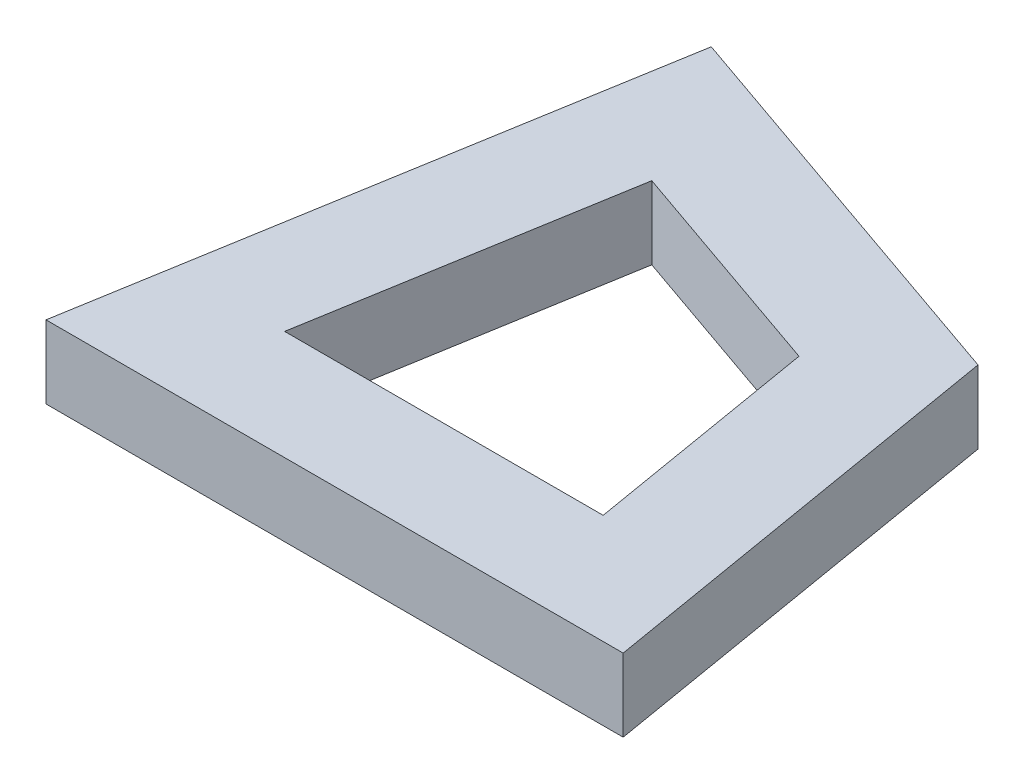
ISO-10303-21;
HEADER;
FILE_DESCRIPTION(('STEP AP214'),'2;1');
FILE_NAME('part.step','',(''),(''),'','','');
FILE_SCHEMA(('AUTOMOTIVE_DESIGN { 1 0 10303 214 1 1 1 1 }'));
ENDSEC;
DATA;
#1=APPLICATION_CONTEXT('core data for automotive mechanical design processes');
#2=APPLICATION_PROTOCOL_DEFINITION('international standard','automotive_design',2000,#1);
#3=PRODUCT_CONTEXT('',#1,'mechanical');
#4=PRODUCT('Part','Part','',(#3));
#5=PRODUCT_RELATED_PRODUCT_CATEGORY('part','',(#4));
#6=PRODUCT_DEFINITION_FORMATION('','',#4);
#7=PRODUCT_DEFINITION_CONTEXT('part definition',#1,'design');
#8=PRODUCT_DEFINITION('design','',#6,#7);
#9=PRODUCT_DEFINITION_SHAPE('','',#8);
#10=(LENGTH_UNIT() NAMED_UNIT(*) SI_UNIT(.MILLI.,.METRE.));
#11=(NAMED_UNIT(*) PLANE_ANGLE_UNIT() SI_UNIT($,.RADIAN.));
#12=(NAMED_UNIT(*) SI_UNIT($,.STERADIAN.) SOLID_ANGLE_UNIT());
#13=UNCERTAINTY_MEASURE_WITH_UNIT(LENGTH_MEASURE(1.E-05),#10,'distance_accuracy_value','');
#14=(GEOMETRIC_REPRESENTATION_CONTEXT(3) GLOBAL_UNCERTAINTY_ASSIGNED_CONTEXT((#13)) GLOBAL_UNIT_ASSIGNED_CONTEXT((#10,
#11,#12)) REPRESENTATION_CONTEXT('',''));
#15=CARTESIAN_POINT('',(0.,0.,0.));
#16=DIRECTION('',(0.,0.,1.));
#17=DIRECTION('',(1.,0.,0.));
#18=AXIS2_PLACEMENT_3D('',#15,#16,#17);
#19=CARTESIAN_POINT('',(0.,2.,0.));
#20=DIRECTION('',(0.,-1.,0.));
#21=DIRECTION('',(0.,0.,-1.));
#22=AXIS2_PLACEMENT_3D('',#19,#20,#21);
#23=PLANE('',#22);
#24=DIRECTION('',(-0.166596655404362,0.,0.986025128689974));
#25=VECTOR('',#24,1.);
#26=CARTESIAN_POINT('',(2.63902101031143,2.,-15.6194073944161));
#27=LINE('',#26,#25);
#28=CARTESIAN_POINT('',(2.63902101031143,2.,-15.6194073944161));
#29=VERTEX_POINT('',#28);
#30=CARTESIAN_POINT('',(0.,2.,0.));
#31=VERTEX_POINT('',#30);
#32=EDGE_CURVE('E140',#29,#31,#27,.T.);
#33=ORIENTED_EDGE('',*,*,#32,.T.);
#34=DIRECTION('',(1.,0.,0.));
#35=VECTOR('',#34,1.);
#36=CARTESIAN_POINT('',(0.,2.,0.));
#37=LINE('',#36,#35);
#38=CARTESIAN_POINT('',(15.84078026,2.,0.));
#39=VERTEX_POINT('',#38);
#40=EDGE_CURVE('E143',#31,#39,#37,.T.);
#41=ORIENTED_EDGE('',*,*,#40,.T.);
#42=DIRECTION('',(-0.166596655404362,0.,-0.986025128689974));
#43=VECTOR('',#42,1.);
#44=CARTESIAN_POINT('',(15.84078026,2.,0.));
#45=LINE('',#44,#43);
#46=CARTESIAN_POINT('',(13.8608746373628,2.,-11.7183426739054));
#47=VERTEX_POINT('',#46);
#48=EDGE_CURVE('E146',#39,#47,#45,.T.);
#49=ORIENTED_EDGE('',*,*,#48,.T.);
#50=DIRECTION('',(-0.944553945341675,0.,-0.32835627653431));
#51=VECTOR('',#50,1.);
#52=CARTESIAN_POINT('',(13.8608746373628,2.,-11.7183426739054));
#53=LINE('',#52,#51);
#54=EDGE_CURVE('E148',#47,#29,#53,.T.);
#55=ORIENTED_EDGE('',*,*,#54,.T.);
#56=EDGE_LOOP('',(#33,#41,#49,#55));
#57=FACE_BOUND('',#56,.T.);
#58=DIRECTION('',(-0.944553945341675,0.,-0.32835627653431));
#59=VECTOR('',#58,1.);
#60=CARTESIAN_POINT('',(11.1986154018467,2.,-9.46772429393779));
#61=LINE('',#60,#59);
#62=CARTESIAN_POINT('',(11.1986154018467,2.,-9.46772429393779));
#63=VERTEX_POINT('',#62);
#64=CARTESIAN_POINT('',(5.00589423380583,2.,-11.6205064345254));
#65=VERTEX_POINT('',#64);
#66=EDGE_CURVE('E104',#63,#65,#61,.T.);
#67=ORIENTED_EDGE('',*,*,#66,.F.);
#68=DIRECTION('',(-0.166596655404362,0.,-0.986025128689974));
#69=VECTOR('',#68,1.);
#70=CARTESIAN_POINT('',(12.2913879936357,2.,-3.));
#71=LINE('',#70,#69);
#72=CARTESIAN_POINT('',(12.2913879936357,2.,-3.));
#73=VERTEX_POINT('',#72);
#74=EDGE_CURVE('E126',#73,#63,#71,.T.);
#75=ORIENTED_EDGE('',*,*,#74,.F.);
#76=DIRECTION('',(1.,0.,0.));
#77=VECTOR('',#76,1.);
#78=CARTESIAN_POINT('',(3.54939226636433,2.,-3.));
#79=LINE('',#78,#77);
#80=CARTESIAN_POINT('',(3.54939226636433,2.,-3.));
#81=VERTEX_POINT('',#80);
#82=EDGE_CURVE('E124',#81,#73,#79,.T.);
#83=ORIENTED_EDGE('',*,*,#82,.F.);
#84=DIRECTION('',(-0.166596655404362,0.,0.986025128689974));
#85=VECTOR('',#84,1.);
#86=CARTESIAN_POINT('',(5.00589423380583,2.,-11.6205064345254));
#87=LINE('',#86,#85);
#88=EDGE_CURVE('E112',#65,#81,#87,.T.);
#89=ORIENTED_EDGE('',*,*,#88,.F.);
#90=EDGE_LOOP('',(#67,#75,#83,#89));
#91=FACE_BOUND('',#90,.T.);
#92=ADVANCED_FACE('F39',(#57,#91),#23,.F.);
#93=CARTESIAN_POINT('',(0.,0.,0.));
#94=DIRECTION('',(0.,-1.,0.));
#95=DIRECTION('',(0.,0.,-1.));
#96=AXIS2_PLACEMENT_3D('',#93,#94,#95);
#97=PLANE('',#96);
#98=DIRECTION('',(-0.166596655404362,0.,0.986025128689974));
#99=VECTOR('',#98,1.);
#100=CARTESIAN_POINT('',(2.63902101031143,0.,-15.6194073944161));
#101=LINE('',#100,#99);
#102=CARTESIAN_POINT('',(2.63902101031143,0.,-15.6194073944161));
#103=VERTEX_POINT('',#102);
#104=CARTESIAN_POINT('',(0.,0.,0.));
#105=VERTEX_POINT('',#104);
#106=EDGE_CURVE('E120',#103,#105,#101,.T.);
#107=ORIENTED_EDGE('',*,*,#106,.F.);
#108=DIRECTION('',(-0.944553945341675,0.,-0.32835627653431));
#109=VECTOR('',#108,1.);
#110=CARTESIAN_POINT('',(13.8608746373628,0.,-11.7183426739054));
#111=LINE('',#110,#109);
#112=CARTESIAN_POINT('',(13.8608746373628,0.,-11.7183426739054));
#113=VERTEX_POINT('',#112);
#114=EDGE_CURVE('E144',#113,#103,#111,.T.);
#115=ORIENTED_EDGE('',*,*,#114,.F.);
#116=DIRECTION('',(-0.166596655404362,0.,-0.986025128689974));
#117=VECTOR('',#116,1.);
#118=CARTESIAN_POINT('',(15.84078026,0.,0.));
#119=LINE('',#118,#117);
#120=CARTESIAN_POINT('',(15.84078026,0.,0.));
#121=VERTEX_POINT('',#120);
#122=EDGE_CURVE('E155',#121,#113,#119,.T.);
#123=ORIENTED_EDGE('',*,*,#122,.F.);
#124=DIRECTION('',(1.,0.,0.));
#125=VECTOR('',#124,1.);
#126=CARTESIAN_POINT('',(0.,0.,0.));
#127=LINE('',#126,#125);
#128=EDGE_CURVE('E153',#105,#121,#127,.T.);
#129=ORIENTED_EDGE('',*,*,#128,.F.);
#130=EDGE_LOOP('',(#107,#115,#123,#129));
#131=FACE_BOUND('',#130,.T.);
#132=DIRECTION('',(-0.166596655404362,0.,-0.986025128689974));
#133=VECTOR('',#132,1.);
#134=CARTESIAN_POINT('',(12.2913879936357,0.,-3.));
#135=LINE('',#134,#133);
#136=CARTESIAN_POINT('',(12.2913879936357,0.,-3.));
#137=VERTEX_POINT('',#136);
#138=CARTESIAN_POINT('',(11.1986154018467,0.,-9.46772429393779));
#139=VERTEX_POINT('',#138);
#140=EDGE_CURVE('E113',#137,#139,#135,.T.);
#141=ORIENTED_EDGE('',*,*,#140,.T.);
#142=DIRECTION('',(-0.944553945341675,0.,-0.32835627653431));
#143=VECTOR('',#142,1.);
#144=CARTESIAN_POINT('',(11.1986154018467,0.,-9.46772429393779));
#145=LINE('',#144,#143);
#146=CARTESIAN_POINT('',(5.00589423380583,0.,-11.6205064345254));
#147=VERTEX_POINT('',#146);
#148=EDGE_CURVE('E62',#139,#147,#145,.T.);
#149=ORIENTED_EDGE('',*,*,#148,.T.);
#150=DIRECTION('',(-0.166596655404362,0.,0.986025128689974));
#151=VECTOR('',#150,1.);
#152=CARTESIAN_POINT('',(5.00589423380583,0.,-11.6205064345254));
#153=LINE('',#152,#151);
#154=CARTESIAN_POINT('',(3.54939226636433,0.,-3.));
#155=VERTEX_POINT('',#154);
#156=EDGE_CURVE('E119',#147,#155,#153,.T.);
#157=ORIENTED_EDGE('',*,*,#156,.T.);
#158=DIRECTION('',(1.,0.,0.));
#159=VECTOR('',#158,1.);
#160=CARTESIAN_POINT('',(3.54939226636433,0.,-3.));
#161=LINE('',#160,#159);
#162=EDGE_CURVE('E132',#155,#137,#161,.T.);
#163=ORIENTED_EDGE('',*,*,#162,.T.);
#164=EDGE_LOOP('',(#141,#149,#157,#163));
#165=FACE_BOUND('',#164,.T.);
#166=ADVANCED_FACE('F173',(#131,#165),#97,.T.);
#167=CARTESIAN_POINT('',(2.63902101031143,2.,-15.6194073944161));
#168=DIRECTION('',(0.986025128689974,0.,0.166596655404362));
#169=DIRECTION('',(0.166596655404362,0.,-0.986025128689974));
#170=AXIS2_PLACEMENT_3D('',#167,#168,#169);
#171=PLANE('',#170);
#172=ORIENTED_EDGE('',*,*,#106,.T.);
#173=DIRECTION('',(0.,-1.,0.));
#174=VECTOR('',#173,1.);
#175=CARTESIAN_POINT('',(0.,2.,0.));
#176=LINE('',#175,#174);
#177=EDGE_CURVE('E11',#31,#105,#176,.T.);
#178=ORIENTED_EDGE('',*,*,#177,.F.);
#179=ORIENTED_EDGE('',*,*,#32,.F.);
#180=DIRECTION('',(0.,-1.,0.));
#181=VECTOR('',#180,1.);
#182=CARTESIAN_POINT('',(2.63902101031143,2.,-15.6194073944161));
#183=LINE('',#182,#181);
#184=EDGE_CURVE('E150',#29,#103,#183,.T.);
#185=ORIENTED_EDGE('',*,*,#184,.T.);
#186=EDGE_LOOP('',(#172,#178,#179,#185));
#187=FACE_BOUND('',#186,.T.);
#188=ADVANCED_FACE('F41',(#187),#171,.F.);
#189=CARTESIAN_POINT('',(0.,2.,0.));
#190=DIRECTION('',(0.,0.,-1.));
#191=DIRECTION('',(-1.,0.,0.));
#192=AXIS2_PLACEMENT_3D('',#189,#190,#191);
#193=PLANE('',#192);
#194=ORIENTED_EDGE('',*,*,#128,.T.);
#195=DIRECTION('',(0.,-1.,0.));
#196=VECTOR('',#195,1.);
#197=CARTESIAN_POINT('',(15.84078026,2.,0.));
#198=LINE('',#197,#196);
#199=EDGE_CURVE('E47',#39,#121,#198,.T.);
#200=ORIENTED_EDGE('',*,*,#199,.F.);
#201=ORIENTED_EDGE('',*,*,#40,.F.);
#202=ORIENTED_EDGE('',*,*,#177,.T.);
#203=EDGE_LOOP('',(#194,#200,#201,#202));
#204=FACE_BOUND('',#203,.T.);
#205=ADVANCED_FACE('F183',(#204),#193,.F.);
#206=CARTESIAN_POINT('',(15.84078026,2.,0.));
#207=DIRECTION('',(-0.986025128689974,0.,0.166596655404362));
#208=DIRECTION('',(0.166596655404362,0.,0.986025128689974));
#209=AXIS2_PLACEMENT_3D('',#206,#207,#208);
#210=PLANE('',#209);
#211=ORIENTED_EDGE('',*,*,#122,.T.);
#212=DIRECTION('',(0.,-1.,0.));
#213=VECTOR('',#212,1.);
#214=CARTESIAN_POINT('',(13.8608746373628,2.,-11.7183426739054));
#215=LINE('',#214,#213);
#216=EDGE_CURVE('E160',#47,#113,#215,.T.);
#217=ORIENTED_EDGE('',*,*,#216,.F.);
#218=ORIENTED_EDGE('',*,*,#48,.F.);
#219=ORIENTED_EDGE('',*,*,#199,.T.);
#220=EDGE_LOOP('',(#211,#217,#218,#219));
#221=FACE_BOUND('',#220,.T.);
#222=ADVANCED_FACE('F167',(#221),#210,.F.);
#223=CARTESIAN_POINT('',(13.8608746373628,2.,-11.7183426739054));
#224=DIRECTION('',(-0.328356276534311,0.,0.944553945341675));
#225=DIRECTION('',(0.944553945341675,0.,0.328356276534311));
#226=AXIS2_PLACEMENT_3D('',#223,#224,#225);
#227=PLANE('',#226);
#228=ORIENTED_EDGE('',*,*,#114,.T.);
#229=ORIENTED_EDGE('',*,*,#184,.F.);
#230=ORIENTED_EDGE('',*,*,#54,.F.);
#231=ORIENTED_EDGE('',*,*,#216,.T.);
#232=EDGE_LOOP('',(#228,#229,#230,#231));
#233=FACE_BOUND('',#232,.T.);
#234=ADVANCED_FACE('F177',(#233),#227,.F.);
#235=CARTESIAN_POINT('',(11.1986154018467,2.,-9.46772429393779));
#236=DIRECTION('',(-0.32835627653431,0.,0.944553945341675));
#237=DIRECTION('',(0.944553945341675,0.,0.32835627653431));
#238=AXIS2_PLACEMENT_3D('',#235,#236,#237);
#239=PLANE('',#238);
#240=ORIENTED_EDGE('',*,*,#148,.F.);
#241=DIRECTION('',(0.,-1.,0.));
#242=VECTOR('',#241,1.);
#243=CARTESIAN_POINT('',(11.1986154018467,2.,-9.46772429393779));
#244=LINE('',#243,#242);
#245=EDGE_CURVE('E108',#63,#139,#244,.T.);
#246=ORIENTED_EDGE('',*,*,#245,.F.);
#247=ORIENTED_EDGE('',*,*,#66,.T.);
#248=DIRECTION('',(0.,-1.,0.));
#249=VECTOR('',#248,1.);
#250=CARTESIAN_POINT('',(5.00589423380583,2.,-11.6205064345254));
#251=LINE('',#250,#249);
#252=EDGE_CURVE('E107',#65,#147,#251,.T.);
#253=ORIENTED_EDGE('',*,*,#252,.T.);
#254=EDGE_LOOP('',(#240,#246,#247,#253));
#255=FACE_BOUND('',#254,.T.);
#256=ADVANCED_FACE('F106',(#255),#239,.T.);
#257=CARTESIAN_POINT('',(5.00589423380583,2.,-11.6205064345254));
#258=DIRECTION('',(0.986025128689974,0.,0.166596655404362));
#259=DIRECTION('',(0.166596655404362,0.,-0.986025128689974));
#260=AXIS2_PLACEMENT_3D('',#257,#258,#259);
#261=PLANE('',#260);
#262=ORIENTED_EDGE('',*,*,#156,.F.);
#263=ORIENTED_EDGE('',*,*,#252,.F.);
#264=ORIENTED_EDGE('',*,*,#88,.T.);
#265=DIRECTION('',(0.,-1.,0.));
#266=VECTOR('',#265,1.);
#267=CARTESIAN_POINT('',(3.54939226636433,2.,-3.));
#268=LINE('',#267,#266);
#269=EDGE_CURVE('E121',#81,#155,#268,.T.);
#270=ORIENTED_EDGE('',*,*,#269,.T.);
#271=EDGE_LOOP('',(#262,#263,#264,#270));
#272=FACE_BOUND('',#271,.T.);
#273=ADVANCED_FACE('F116',(#272),#261,.T.);
#274=CARTESIAN_POINT('',(3.54939226636433,2.,-3.));
#275=DIRECTION('',(0.,0.,-1.));
#276=DIRECTION('',(-1.,0.,0.));
#277=AXIS2_PLACEMENT_3D('',#274,#275,#276);
#278=PLANE('',#277);
#279=ORIENTED_EDGE('',*,*,#162,.F.);
#280=ORIENTED_EDGE('',*,*,#269,.F.);
#281=ORIENTED_EDGE('',*,*,#82,.T.);
#282=DIRECTION('',(0.,-1.,0.));
#283=VECTOR('',#282,1.);
#284=CARTESIAN_POINT('',(12.2913879936357,2.,-3.));
#285=LINE('',#284,#283);
#286=EDGE_CURVE('E54',#73,#137,#285,.T.);
#287=ORIENTED_EDGE('',*,*,#286,.T.);
#288=EDGE_LOOP('',(#279,#280,#281,#287));
#289=FACE_BOUND('',#288,.T.);
#290=ADVANCED_FACE('F206',(#289),#278,.T.);
#291=CARTESIAN_POINT('',(12.2913879936357,2.,-3.));
#292=DIRECTION('',(-0.986025128689974,0.,0.166596655404362));
#293=DIRECTION('',(0.166596655404362,0.,0.986025128689974));
#294=AXIS2_PLACEMENT_3D('',#291,#292,#293);
#295=PLANE('',#294);
#296=ORIENTED_EDGE('',*,*,#140,.F.);
#297=ORIENTED_EDGE('',*,*,#286,.F.);
#298=ORIENTED_EDGE('',*,*,#74,.T.);
#299=ORIENTED_EDGE('',*,*,#245,.T.);
#300=EDGE_LOOP('',(#296,#297,#298,#299));
#301=FACE_BOUND('',#300,.T.);
#302=ADVANCED_FACE('F210',(#301),#295,.T.);
#303=CLOSED_SHELL('',(#92,#166,#188,#205,#222,#234,#256,#273,#290,#302));
#304=MANIFOLD_SOLID_BREP('B2',#303);
#305=ADVANCED_BREP_SHAPE_REPRESENTATION('',(#18,#304),#14);
#306=SHAPE_DEFINITION_REPRESENTATION(#9,#305);
ENDSEC;
END-ISO-10303-21;
